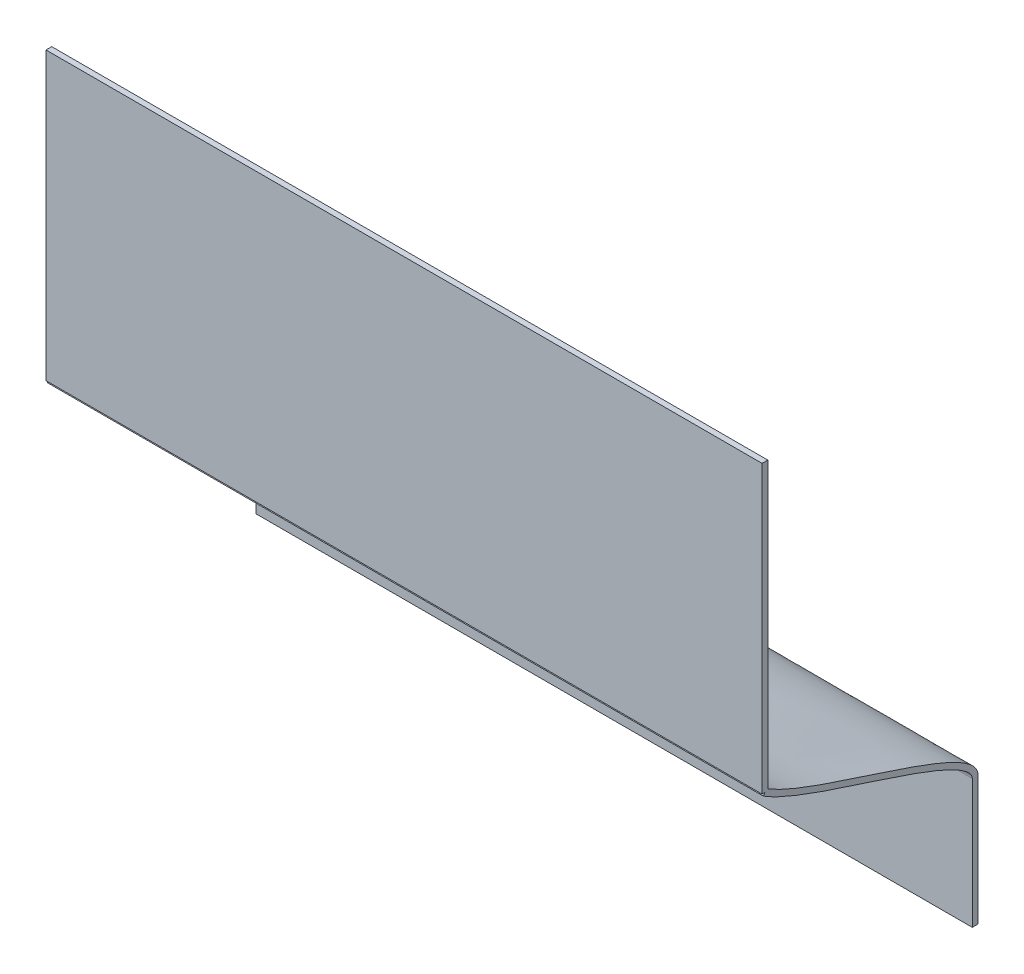
ISO-10303-21;
HEADER;
FILE_DESCRIPTION(('STEP AP214'),'2;1');
FILE_NAME('part.step','',(''),(''),'','','');
FILE_SCHEMA(('AUTOMOTIVE_DESIGN { 1 0 10303 214 1 1 1 1 }'));
ENDSEC;
DATA;
#1=APPLICATION_CONTEXT('core data for automotive mechanical design processes');
#2=APPLICATION_PROTOCOL_DEFINITION('international standard','automotive_design',2000,#1);
#3=PRODUCT_CONTEXT('',#1,'mechanical');
#4=PRODUCT('Part','Part','',(#3));
#5=PRODUCT_RELATED_PRODUCT_CATEGORY('part','',(#4));
#6=PRODUCT_DEFINITION_FORMATION('','',#4);
#7=PRODUCT_DEFINITION_CONTEXT('part definition',#1,'design');
#8=PRODUCT_DEFINITION('design','',#6,#7);
#9=PRODUCT_DEFINITION_SHAPE('','',#8);
#10=(LENGTH_UNIT() NAMED_UNIT(*) SI_UNIT(.MILLI.,.METRE.));
#11=(NAMED_UNIT(*) PLANE_ANGLE_UNIT() SI_UNIT($,.RADIAN.));
#12=(NAMED_UNIT(*) SI_UNIT($,.STERADIAN.) SOLID_ANGLE_UNIT());
#13=UNCERTAINTY_MEASURE_WITH_UNIT(LENGTH_MEASURE(1.E-05),#10,'distance_accuracy_value','');
#14=(GEOMETRIC_REPRESENTATION_CONTEXT(3) GLOBAL_UNCERTAINTY_ASSIGNED_CONTEXT((#13)) GLOBAL_UNIT_ASSIGNED_CONTEXT((#10,
#11,#12)) REPRESENTATION_CONTEXT('',''));
#15=CARTESIAN_POINT('',(0.,0.,0.));
#16=DIRECTION('',(0.,0.,1.));
#17=DIRECTION('',(1.,0.,0.));
#18=AXIS2_PLACEMENT_3D('',#15,#16,#17);
#19=CARTESIAN_POINT('',(0.,5.36538784360869,7.29329899615201));
#20=DIRECTION('',(0.,0.532989961520087,0.846121563913139));
#21=DIRECTION('',(-1.,0.,0.));
#22=AXIS2_PLACEMENT_3D('',#19,#20,#21);
#23=PLANE('',#22);
#24=DIRECTION('',(0.,0.846121563913139,-0.532989961520087));
#25=VECTOR('',#24,1.);
#26=CARTESIAN_POINT('',(12.5,5.36538784360869,7.29329899615201));
#27=LINE('',#26,#25);
#28=CARTESIAN_POINT('',(12.5,5.36538784360869,7.29329899615201));
#29=VERTEX_POINT('',#28);
#30=CARTESIAN_POINT('',(12.5,5.45000000000001,7.24));
#31=VERTEX_POINT('',#30);
#32=EDGE_CURVE('E167',#29,#31,#27,.T.);
#33=ORIENTED_EDGE('',*,*,#32,.T.);
#34=DIRECTION('',(-1.,0.,0.));
#35=VECTOR('',#34,1.);
#36=CARTESIAN_POINT('',(0.,5.45000000000001,7.24));
#37=LINE('',#36,#35);
#38=CARTESIAN_POINT('',(-12.5,5.45000000000001,7.24));
#39=VERTEX_POINT('',#38);
#40=EDGE_CURVE('E11',#31,#39,#37,.T.);
#41=ORIENTED_EDGE('',*,*,#40,.T.);
#42=DIRECTION('',(0.,-0.846121563913139,0.532989961520087));
#43=VECTOR('',#42,1.);
#44=CARTESIAN_POINT('',(-12.5,5.53461215639132,7.18670100384799));
#45=LINE('',#44,#43);
#46=CARTESIAN_POINT('',(-12.5,5.36538784360869,7.29329899615201));
#47=VERTEX_POINT('',#46);
#48=EDGE_CURVE('E149',#39,#47,#45,.T.);
#49=ORIENTED_EDGE('',*,*,#48,.T.);
#50=DIRECTION('',(1.,0.,0.));
#51=VECTOR('',#50,1.);
#52=CARTESIAN_POINT('',(-12.5,5.36538784360869,7.29329899615201));
#53=LINE('',#52,#51);
#54=EDGE_CURVE('E151',#47,#29,#53,.T.);
#55=ORIENTED_EDGE('',*,*,#54,.T.);
#56=EDGE_LOOP('',(#33,#41,#49,#55));
#57=FACE_BOUND('',#56,.T.);
#58=ADVANCED_FACE('F35',(#57),#23,.T.);
#59=CARTESIAN_POINT('',(12.5,2.25000000000001,-0.2));
#60=CARTESIAN_POINT('',(12.5,2.34111976886381,-0.199999900198077));
#61=CARTESIAN_POINT('',(12.5,2.42678009284915,-0.167606025043886));
#62=CARTESIAN_POINT('',(12.5,2.58409405696768,-0.0628201092410751));
#63=CARTESIAN_POINT('',(12.5,2.6569705568427,0.00960294741212795));
#64=CARTESIAN_POINT('',(12.5,2.87016752896252,0.275656685973047));
#65=CARTESIAN_POINT('',(12.5,3.00556691664487,0.51956146608584));
#66=CARTESIAN_POINT('',(12.5,3.41107928163634,1.39497709864719));
#67=CARTESIAN_POINT('',(12.5,3.67804817930948,2.17061541078781));
#68=CARTESIAN_POINT('',(12.5,4.21195982334858,3.79570896205555));
#69=CARTESIAN_POINT('',(12.5,4.47849036083489,4.6448641891336));
#70=CARTESIAN_POINT('',(12.5,5.00988620985733,6.13474438618378));
#71=CARTESIAN_POINT('',(12.5,5.27610427714114,6.77631972264641));
#72=CARTESIAN_POINT('',(12.5,5.53461215639132,7.18670100384799));
#73=CARTESIAN_POINT('',(-12.5,2.25000000000001,-0.2));
#74=CARTESIAN_POINT('',(-12.5,2.34111976886383,-0.199999900198073));
#75=CARTESIAN_POINT('',(-12.5,2.42678009284913,-0.167606025043884));
#76=CARTESIAN_POINT('',(-12.5,2.5840940569677,-0.0628201092410732));
#77=CARTESIAN_POINT('',(-12.5,2.65697055684268,0.00960294741213055));
#78=CARTESIAN_POINT('',(-12.5,2.87016752896257,0.275656685973049));
#79=CARTESIAN_POINT('',(-12.5,3.00556691664494,0.519561466085843));
#80=CARTESIAN_POINT('',(-12.5,3.41107928163621,1.3949770986472));
#81=CARTESIAN_POINT('',(-12.5,3.67804817930948,2.17061541078763));
#82=CARTESIAN_POINT('',(-12.5,4.21195982334858,3.79570896205573));
#83=CARTESIAN_POINT('',(-12.5,4.47849036083455,4.64486418913326));
#84=CARTESIAN_POINT('',(-12.5,5.00988620985767,6.13474438618412));
#85=CARTESIAN_POINT('',(-12.5,5.27610427714095,6.77631972264611));
#86=CARTESIAN_POINT('',(-12.5,5.53461215639132,7.18670100384799));
#87=B_SPLINE_SURFACE_WITH_KNOTS('',1,3,((#59,#60,#61,#62,#63,#64,#65,#66,#67,#68,#69,#70,#71,
#72),(#73,#74,#75,#76,#77,#78,#79,#80,#81,#82,#83,#84,#85,#86)),.UNSPECIFIED.,.F.,.F.,.F.,(2,2),
(4,2,2,2,2,2,4),(0.,1.),(0.,0.0625,0.125,0.25,0.5,0.75,1.),.UNSPECIFIED.);
#88=CARTESIAN_POINT('',(-12.5,2.25000000000001,-0.2));
#89=CARTESIAN_POINT('',(-12.5,2.34111976886383,-0.199999900198073));
#90=CARTESIAN_POINT('',(-12.5,2.42678009284913,-0.167606025043884));
#91=CARTESIAN_POINT('',(-12.5,2.5840940569677,-0.0628201092410732));
#92=CARTESIAN_POINT('',(-12.5,2.65697055684268,0.00960294741213055));
#93=CARTESIAN_POINT('',(-12.5,2.87016752896257,0.275656685973049));
#94=CARTESIAN_POINT('',(-12.5,3.00556691664494,0.519561466085843));
#95=CARTESIAN_POINT('',(-12.5,3.41107928163621,1.3949770986472));
#96=CARTESIAN_POINT('',(-12.5,3.67804817930948,2.17061541078763));
#97=CARTESIAN_POINT('',(-12.5,4.21195982334858,3.79570896205573));
#98=CARTESIAN_POINT('',(-12.5,4.47849036083455,4.64486418913326));
#99=CARTESIAN_POINT('',(-12.5,5.00988620985767,6.13474438618412));
#100=CARTESIAN_POINT('',(-12.5,5.27610427714095,6.77631972264611));
#101=CARTESIAN_POINT('',(-12.5,5.53461215639132,7.18670100384799));
#102=B_SPLINE_CURVE_WITH_KNOTS('',3,(#88,#89,#90,#91,#92,#93,#94,#95,#96,#97,#98,#99,#100,#101),
.UNSPECIFIED.,.F.,.F.,(4,2,2,2,2,2,4),(0.,0.0625,0.125,0.25,0.5,0.75,1.),.UNSPECIFIED.);
#103=CARTESIAN_POINT('',(-12.5,2.25000000000001,-0.2));
#104=VERTEX_POINT('',#103);
#105=CARTESIAN_POINT('',(-12.5,5.50576186846246,7.14));
#106=VERTEX_POINT('',#105);
#107=EDGE_CURVE('E140',#104,#106,#102,.T.);
#108=DIRECTION('',(-1.,0.,0.));
#109=VECTOR('',#108,1.);
#110=CARTESIAN_POINT('',(0.,5.50576186846246,7.14));
#111=LINE('',#110,#109);
#112=CARTESIAN_POINT('',(12.5,5.50576186846246,7.14));
#113=VERTEX_POINT('',#112);
#114=EDGE_CURVE('E43',#106,#113,#111,.F.);
#115=CARTESIAN_POINT('',(12.5,2.25000000000001,-0.2));
#116=CARTESIAN_POINT('',(12.5,2.34111976886381,-0.199999900198077));
#117=CARTESIAN_POINT('',(12.5,2.42678009284915,-0.167606025043886));
#118=CARTESIAN_POINT('',(12.5,2.58409405696768,-0.0628201092410751));
#119=CARTESIAN_POINT('',(12.5,2.6569705568427,0.00960294741212795));
#120=CARTESIAN_POINT('',(12.5,2.87016752896252,0.275656685973047));
#121=CARTESIAN_POINT('',(12.5,3.00556691664487,0.51956146608584));
#122=CARTESIAN_POINT('',(12.5,3.41107928163634,1.39497709864719));
#123=CARTESIAN_POINT('',(12.5,3.67804817930948,2.17061541078781));
#124=CARTESIAN_POINT('',(12.5,4.21195982334858,3.79570896205555));
#125=CARTESIAN_POINT('',(12.5,4.47849036083489,4.6448641891336));
#126=CARTESIAN_POINT('',(12.5,5.00988620985733,6.13474438618378));
#127=CARTESIAN_POINT('',(12.5,5.27610427714114,6.77631972264641));
#128=CARTESIAN_POINT('',(12.5,5.53461215639132,7.18670100384799));
#129=B_SPLINE_CURVE_WITH_KNOTS('',3,(#115,#116,#117,#118,#119,#120,#121,#122,#123,#124,#125,
#126,#127,#128),.UNSPECIFIED.,.F.,.F.,(4,2,2,2,2,2,4),(0.,0.0625,0.125,0.25,0.5,0.75,1.),.UNSPECIFIED.);
#130=CARTESIAN_POINT('',(12.5,2.25000000000001,-0.2));
#131=VERTEX_POINT('',#130);
#132=EDGE_CURVE('E152',#131,#113,#129,.T.);
#133=DIRECTION('',(-1.,0.,0.));
#134=VECTOR('',#133,1.);
#135=CARTESIAN_POINT('',(-12.5,2.25000000000001,-0.2));
#136=LINE('',#135,#134);
#137=EDGE_CURVE('E82',#131,#104,#136,.T.);
#138=ORIENTED_EDGE('',*,*,#107,.T.);
#139=ORIENTED_EDGE('',*,*,#114,.T.);
#140=ORIENTED_EDGE('',*,*,#132,.F.);
#141=ORIENTED_EDGE('',*,*,#137,.T.);
#142=EDGE_LOOP('',(#138,#139,#140,#141));
#143=FACE_BOUND('',#142,.T.);
#144=ADVANCED_FACE('F205',(#143),#87,.T.);
#145=CARTESIAN_POINT('',(12.5,2.25000000000001,-0.2));
#146=DIRECTION('',(1.,0.,0.));
#147=DIRECTION('',(0.,0.,-1.));
#148=AXIS2_PLACEMENT_3D('',#145,#146,#147);
#149=PLANE('',#148);
#150=DIRECTION('',(0.,0.,-1.));
#151=VECTOR('',#150,1.);
#152=CARTESIAN_POINT('',(12.5,5.45000000000001,7.34));
#153=LINE('',#152,#151);
#154=CARTESIAN_POINT('',(12.5,5.45000000000001,7.34));
#155=VERTEX_POINT('',#154);
#156=EDGE_CURVE('E221',#155,#31,#153,.T.);
#157=ORIENTED_EDGE('',*,*,#156,.T.);
#158=ORIENTED_EDGE('',*,*,#32,.F.);
#159=CARTESIAN_POINT('',(12.5,2.25000000000001,0.));
#160=CARTESIAN_POINT('',(12.5,2.29221356452214,-5.14521191429565E-09));
#161=CARTESIAN_POINT('',(12.5,2.3398865738175,0.0148212267414871));
#162=CARTESIAN_POINT('',(12.5,2.44923927636569,0.0876605716059741));
#163=CARTESIAN_POINT('',(12.5,2.50969610982398,0.145647721935439));
#164=CARTESIAN_POINT('',(12.5,2.69649913770415,0.37876385033182));
#165=CARTESIAN_POINT('',(12.5,2.82776641668844,0.611558341208864));
#166=CARTESIAN_POINT('',(12.5,3.22225405169706,1.4631739117634));
#167=CARTESIAN_POINT('',(12.5,3.48861848735676,2.23480127110167));
#168=CARTESIAN_POINT('',(12.5,4.0213735099852,3.85637435605498));
#169=CARTESIAN_POINT('',(12.5,4.28817618828164,4.70662001455525));
#170=CARTESIAN_POINT('',(12.5,4.82344724102616,6.20736516012738));
#171=CARTESIAN_POINT('',(12.5,5.09112243714558,6.85790261502571));
#172=CARTESIAN_POINT('',(12.5,5.36538784360869,7.29329899615201));
#173=B_SPLINE_CURVE_WITH_KNOTS('',3,(#159,#160,#161,#162,#163,#164,#165,#166,#167,#168,#169,
#170,#171,#172),.UNSPECIFIED.,.F.,.F.,(4,2,2,2,2,2,4),(0.,0.0625,0.125,0.25,0.5,0.75,1.),.UNSPECIFIED.);
#174=CARTESIAN_POINT('',(12.5,2.25000000000001,0.));
#175=VERTEX_POINT('',#174);
#176=EDGE_CURVE('E156',#175,#29,#173,.T.);
#177=ORIENTED_EDGE('',*,*,#176,.F.);
#178=DIRECTION('',(0.,1.,0.));
#179=VECTOR('',#178,1.);
#180=CARTESIAN_POINT('',(12.5,2.25000000000001,0.));
#181=LINE('',#180,#179);
#182=CARTESIAN_POINT('',(12.5,-2.24999999999999,0.));
#183=VERTEX_POINT('',#182);
#184=EDGE_CURVE('E177',#183,#175,#181,.T.);
#185=ORIENTED_EDGE('',*,*,#184,.F.);
#186=DIRECTION('',(0.,0.,1.));
#187=VECTOR('',#186,1.);
#188=CARTESIAN_POINT('',(12.5,-2.24999999999999,-0.2));
#189=LINE('',#188,#187);
#190=CARTESIAN_POINT('',(12.5,-2.24999999999999,-0.2));
#191=VERTEX_POINT('',#190);
#192=EDGE_CURVE('E59',#191,#183,#189,.T.);
#193=ORIENTED_EDGE('',*,*,#192,.F.);
#194=DIRECTION('',(0.,1.,0.));
#195=VECTOR('',#194,1.);
#196=CARTESIAN_POINT('',(12.5,2.25000000000001,-0.2));
#197=LINE('',#196,#195);
#198=EDGE_CURVE('E181',#191,#131,#197,.T.);
#199=ORIENTED_EDGE('',*,*,#198,.T.);
#200=ORIENTED_EDGE('',*,*,#132,.T.);
#201=DIRECTION('',(0.,1.,0.));
#202=VECTOR('',#201,1.);
#203=CARTESIAN_POINT('',(12.5,5.45000000000001,7.14));
#204=LINE('',#203,#202);
#205=CARTESIAN_POINT('',(12.5,15.45,7.14));
#206=VERTEX_POINT('',#205);
#207=EDGE_CURVE('E50',#113,#206,#204,.T.);
#208=ORIENTED_EDGE('',*,*,#207,.T.);
#209=DIRECTION('',(0.,0.,-1.));
#210=VECTOR('',#209,1.);
#211=CARTESIAN_POINT('',(12.5,15.45,7.34));
#212=LINE('',#211,#210);
#213=CARTESIAN_POINT('',(12.5,15.45,7.34));
#214=VERTEX_POINT('',#213);
#215=EDGE_CURVE('E123',#214,#206,#212,.T.);
#216=ORIENTED_EDGE('',*,*,#215,.F.);
#217=DIRECTION('',(0.,1.,0.));
#218=VECTOR('',#217,1.);
#219=CARTESIAN_POINT('',(12.5,5.45000000000001,7.34));
#220=LINE('',#219,#218);
#221=EDGE_CURVE('E129',#155,#214,#220,.T.);
#222=ORIENTED_EDGE('',*,*,#221,.F.);
#223=EDGE_LOOP('',(#157,#158,#177,#185,#193,#199,#200,#208,#216,#222));
#224=FACE_BOUND('',#223,.T.);
#225=ADVANCED_FACE('F37',(#224),#149,.T.);
#226=CARTESIAN_POINT('',(-12.5,-2.25,-0.2));
#227=DIRECTION('',(0.,-1.,0.));
#228=DIRECTION('',(1.,0.,0.));
#229=AXIS2_PLACEMENT_3D('',#226,#227,#228);
#230=PLANE('',#229);
#231=DIRECTION('',(1.,0.,0.));
#232=VECTOR('',#231,1.);
#233=CARTESIAN_POINT('',(-12.5,-2.25,0.));
#234=LINE('',#233,#232);
#235=CARTESIAN_POINT('',(-12.5,-2.25,0.));
#236=VERTEX_POINT('',#235);
#237=EDGE_CURVE('E186',#236,#183,#234,.T.);
#238=ORIENTED_EDGE('',*,*,#237,.F.);
#239=DIRECTION('',(0.,0.,1.));
#240=VECTOR('',#239,1.);
#241=CARTESIAN_POINT('',(-12.5,-2.25,-0.2));
#242=LINE('',#241,#240);
#243=CARTESIAN_POINT('',(-12.5,-2.25,-0.2));
#244=VERTEX_POINT('',#243);
#245=EDGE_CURVE('E193',#244,#236,#242,.T.);
#246=ORIENTED_EDGE('',*,*,#245,.F.);
#247=DIRECTION('',(1.,0.,0.));
#248=VECTOR('',#247,1.);
#249=CARTESIAN_POINT('',(-12.5,-2.25,-0.2));
#250=LINE('',#249,#248);
#251=EDGE_CURVE('E191',#244,#191,#250,.T.);
#252=ORIENTED_EDGE('',*,*,#251,.T.);
#253=ORIENTED_EDGE('',*,*,#192,.T.);
#254=EDGE_LOOP('',(#238,#246,#252,#253));
#255=FACE_BOUND('',#254,.T.);
#256=ADVANCED_FACE('F211',(#255),#230,.T.);
#257=CARTESIAN_POINT('',(-12.5,2.25000000000001,-0.2));
#258=DIRECTION('',(-1.,0.,0.));
#259=DIRECTION('',(0.,0.,1.));
#260=AXIS2_PLACEMENT_3D('',#257,#258,#259);
#261=PLANE('',#260);
#262=ORIENTED_EDGE('',*,*,#48,.F.);
#263=DIRECTION('',(0.,0.,-1.));
#264=VECTOR('',#263,1.);
#265=CARTESIAN_POINT('',(-12.5,5.45000000000001,7.34));
#266=LINE('',#265,#264);
#267=CARTESIAN_POINT('',(-12.5,5.45000000000001,7.34));
#268=VERTEX_POINT('',#267);
#269=EDGE_CURVE('E145',#268,#39,#266,.T.);
#270=ORIENTED_EDGE('',*,*,#269,.F.);
#271=DIRECTION('',(0.,-1.,0.));
#272=VECTOR('',#271,1.);
#273=CARTESIAN_POINT('',(-12.5,5.45000000000001,7.34));
#274=LINE('',#273,#272);
#275=CARTESIAN_POINT('',(-12.5,15.45,7.34));
#276=VERTEX_POINT('',#275);
#277=EDGE_CURVE('E128',#276,#268,#274,.T.);
#278=ORIENTED_EDGE('',*,*,#277,.F.);
#279=DIRECTION('',(0.,0.,-1.));
#280=VECTOR('',#279,1.);
#281=CARTESIAN_POINT('',(-12.5,15.45,7.34));
#282=LINE('',#281,#280);
#283=CARTESIAN_POINT('',(-12.5,15.45,7.14));
#284=VERTEX_POINT('',#283);
#285=EDGE_CURVE('E125',#276,#284,#282,.T.);
#286=ORIENTED_EDGE('',*,*,#285,.T.);
#287=DIRECTION('',(0.,-1.,0.));
#288=VECTOR('',#287,1.);
#289=CARTESIAN_POINT('',(-12.5,5.45000000000001,7.14));
#290=LINE('',#289,#288);
#291=EDGE_CURVE('E137',#284,#106,#290,.T.);
#292=ORIENTED_EDGE('',*,*,#291,.T.);
#293=ORIENTED_EDGE('',*,*,#107,.F.);
#294=DIRECTION('',(0.,-1.,0.));
#295=VECTOR('',#294,1.);
#296=CARTESIAN_POINT('',(-12.5,2.25000000000001,-0.2));
#297=LINE('',#296,#295);
#298=EDGE_CURVE('E188',#104,#244,#297,.T.);
#299=ORIENTED_EDGE('',*,*,#298,.T.);
#300=ORIENTED_EDGE('',*,*,#245,.T.);
#301=DIRECTION('',(0.,-1.,0.));
#302=VECTOR('',#301,1.);
#303=CARTESIAN_POINT('',(-12.5,2.25000000000001,0.));
#304=LINE('',#303,#302);
#305=CARTESIAN_POINT('',(-12.5,2.25000000000001,0.));
#306=VERTEX_POINT('',#305);
#307=EDGE_CURVE('E197',#306,#236,#304,.T.);
#308=ORIENTED_EDGE('',*,*,#307,.F.);
#309=CARTESIAN_POINT('',(-12.5,2.25000000000001,0.));
#310=CARTESIAN_POINT('',(-12.5,2.29221356452213,-5.14521091780681E-09));
#311=CARTESIAN_POINT('',(-12.5,2.33988657381752,0.014821226741489));
#312=CARTESIAN_POINT('',(-12.5,2.44923927636568,0.0876605716059761));
#313=CARTESIAN_POINT('',(-12.5,2.50969610982398,0.145647721935442));
#314=CARTESIAN_POINT('',(-12.5,2.69649913770415,0.378763850331823));
#315=CARTESIAN_POINT('',(-12.5,2.82776641668837,0.611558341208867));
#316=CARTESIAN_POINT('',(-12.5,3.2222540516972,1.4631739117634));
#317=CARTESIAN_POINT('',(-12.5,3.48861848735676,2.23480127110148));
#318=CARTESIAN_POINT('',(-12.5,4.0213735099852,3.85637435605517));
#319=CARTESIAN_POINT('',(-12.5,4.28817618828164,4.70662001455525));
#320=CARTESIAN_POINT('',(-12.5,4.82344724102616,6.20736516012738));
#321=CARTESIAN_POINT('',(-12.5,5.0911224371465,6.85790261502513));
#322=CARTESIAN_POINT('',(-12.5,5.36538784360869,7.29329899615201));
#323=B_SPLINE_CURVE_WITH_KNOTS('',3,(#309,#310,#311,#312,#313,#314,#315,#316,#317,#318,#319,
#320,#321,#322),.UNSPECIFIED.,.F.,.F.,(4,2,2,2,2,2,4),(0.,0.0625,0.125,0.25,0.5,0.75,1.),.UNSPECIFIED.);
#324=EDGE_CURVE('E143',#306,#47,#323,.T.);
#325=ORIENTED_EDGE('',*,*,#324,.T.);
#326=EDGE_LOOP('',(#262,#270,#278,#286,#292,#293,#299,#300,#308,#325));
#327=FACE_BOUND('',#326,.T.);
#328=ADVANCED_FACE('F215',(#327),#261,.T.);
#329=CARTESIAN_POINT('',(0.,0.,-0.2));
#330=DIRECTION('',(0.,0.,1.));
#331=DIRECTION('',(1.,0.,0.));
#332=AXIS2_PLACEMENT_3D('',#329,#330,#331);
#333=PLANE('',#332);
#334=ORIENTED_EDGE('',*,*,#198,.F.);
#335=ORIENTED_EDGE('',*,*,#251,.F.);
#336=ORIENTED_EDGE('',*,*,#298,.F.);
#337=ORIENTED_EDGE('',*,*,#137,.F.);
#338=EDGE_LOOP('',(#334,#335,#336,#337));
#339=FACE_BOUND('',#338,.T.);
#340=ADVANCED_FACE('F210',(#339),#333,.F.);
#341=CARTESIAN_POINT('',(0.,0.,0.));
#342=DIRECTION('',(0.,0.,1.));
#343=DIRECTION('',(1.,0.,0.));
#344=AXIS2_PLACEMENT_3D('',#341,#342,#343);
#345=PLANE('',#344);
#346=ORIENTED_EDGE('',*,*,#184,.T.);
#347=DIRECTION('',(-1.,0.,0.));
#348=VECTOR('',#347,1.);
#349=CARTESIAN_POINT('',(-12.5,2.25000000000001,0.));
#350=LINE('',#349,#348);
#351=EDGE_CURVE('E195',#175,#306,#350,.T.);
#352=ORIENTED_EDGE('',*,*,#351,.T.);
#353=ORIENTED_EDGE('',*,*,#307,.T.);
#354=ORIENTED_EDGE('',*,*,#237,.T.);
#355=EDGE_LOOP('',(#346,#352,#353,#354));
#356=FACE_BOUND('',#355,.T.);
#357=ADVANCED_FACE('F234',(#356),#345,.T.);
#358=CARTESIAN_POINT('',(-12.5,2.25000000000001,0.));
#359=CARTESIAN_POINT('',(-12.5,2.29221356452213,-5.14521091780681E-09));
#360=CARTESIAN_POINT('',(-12.5,2.33988657381752,0.014821226741489));
#361=CARTESIAN_POINT('',(-12.5,2.44923927636568,0.0876605716059761));
#362=CARTESIAN_POINT('',(-12.5,2.50969610982398,0.145647721935442));
#363=CARTESIAN_POINT('',(-12.5,2.69649913770415,0.378763850331823));
#364=CARTESIAN_POINT('',(-12.5,2.82776641668837,0.611558341208867));
#365=CARTESIAN_POINT('',(-12.5,3.2222540516972,1.4631739117634));
#366=CARTESIAN_POINT('',(-12.5,3.48861848735676,2.23480127110148));
#367=CARTESIAN_POINT('',(-12.5,4.0213735099852,3.85637435605517));
#368=CARTESIAN_POINT('',(-12.5,4.28817618828164,4.70662001455525));
#369=CARTESIAN_POINT('',(-12.5,4.82344724102616,6.20736516012738));
#370=CARTESIAN_POINT('',(-12.5,5.0911224371465,6.85790261502513));
#371=CARTESIAN_POINT('',(-12.5,5.36538784360869,7.29329899615201));
#372=CARTESIAN_POINT('',(12.5,2.25000000000001,0.));
#373=CARTESIAN_POINT('',(12.5,2.29221356452214,-5.14521191429565E-09));
#374=CARTESIAN_POINT('',(12.5,2.3398865738175,0.0148212267414871));
#375=CARTESIAN_POINT('',(12.5,2.44923927636569,0.0876605716059741));
#376=CARTESIAN_POINT('',(12.5,2.50969610982398,0.145647721935439));
#377=CARTESIAN_POINT('',(12.5,2.69649913770415,0.37876385033182));
#378=CARTESIAN_POINT('',(12.5,2.82776641668844,0.611558341208864));
#379=CARTESIAN_POINT('',(12.5,3.22225405169706,1.4631739117634));
#380=CARTESIAN_POINT('',(12.5,3.48861848735676,2.23480127110167));
#381=CARTESIAN_POINT('',(12.5,4.0213735099852,3.85637435605498));
#382=CARTESIAN_POINT('',(12.5,4.28817618828164,4.70662001455525));
#383=CARTESIAN_POINT('',(12.5,4.82344724102616,6.20736516012738));
#384=CARTESIAN_POINT('',(12.5,5.09112243714558,6.85790261502571));
#385=CARTESIAN_POINT('',(12.5,5.36538784360869,7.29329899615201));
#386=B_SPLINE_SURFACE_WITH_KNOTS('',1,3,((#358,#359,#360,#361,#362,#363,#364,#365,#366,#367,
#368,#369,#370,#371),(#372,#373,#374,#375,#376,#377,#378,#379,#380,#381,#382,#383,#384,#385)),
.UNSPECIFIED.,.F.,.F.,.F.,(2,2),(4,2,2,2,2,2,4),(0.,1.),(0.,0.0625,0.125,0.25,0.5,0.75,1.),.UNSPECIFIED.);
#387=ORIENTED_EDGE('',*,*,#176,.T.);
#388=ORIENTED_EDGE('',*,*,#54,.F.);
#389=ORIENTED_EDGE('',*,*,#324,.F.);
#390=ORIENTED_EDGE('',*,*,#351,.F.);
#391=EDGE_LOOP('',(#387,#388,#389,#390));
#392=FACE_BOUND('',#391,.T.);
#393=ADVANCED_FACE('F231',(#392),#386,.T.);
#394=CARTESIAN_POINT('',(12.5,15.45,7.34));
#395=DIRECTION('',(0.,-1.,0.));
#396=DIRECTION('',(0.,0.,-1.));
#397=AXIS2_PLACEMENT_3D('',#394,#395,#396);
#398=PLANE('',#397);
#399=DIRECTION('',(-1.,0.,0.));
#400=VECTOR('',#399,1.);
#401=CARTESIAN_POINT('',(12.5,15.45,7.14));
#402=LINE('',#401,#400);
#403=EDGE_CURVE('E216',#206,#284,#402,.T.);
#404=ORIENTED_EDGE('',*,*,#403,.T.);
#405=ORIENTED_EDGE('',*,*,#285,.F.);
#406=DIRECTION('',(-1.,0.,0.));
#407=VECTOR('',#406,1.);
#408=CARTESIAN_POINT('',(12.5,15.45,7.34));
#409=LINE('',#408,#407);
#410=EDGE_CURVE('E119',#214,#276,#409,.T.);
#411=ORIENTED_EDGE('',*,*,#410,.F.);
#412=ORIENTED_EDGE('',*,*,#215,.T.);
#413=EDGE_LOOP('',(#404,#405,#411,#412));
#414=FACE_BOUND('',#413,.T.);
#415=ADVANCED_FACE('F121',(#414),#398,.F.);
#416=CARTESIAN_POINT('',(12.5,5.45000000000001,7.34));
#417=DIRECTION('',(0.,1.,0.));
#418=DIRECTION('',(0.,0.,1.));
#419=AXIS2_PLACEMENT_3D('',#416,#417,#418);
#420=PLANE('',#419);
#421=ORIENTED_EDGE('',*,*,#40,.F.);
#422=ORIENTED_EDGE('',*,*,#156,.F.);
#423=DIRECTION('',(1.,0.,0.));
#424=VECTOR('',#423,1.);
#425=CARTESIAN_POINT('',(12.5,5.45000000000001,7.34));
#426=LINE('',#425,#424);
#427=EDGE_CURVE('E134',#268,#155,#426,.T.);
#428=ORIENTED_EDGE('',*,*,#427,.F.);
#429=ORIENTED_EDGE('',*,*,#269,.T.);
#430=EDGE_LOOP('',(#421,#422,#428,#429));
#431=FACE_BOUND('',#430,.T.);
#432=ADVANCED_FACE('F224',(#431),#420,.F.);
#433=CARTESIAN_POINT('',(0.,0.,7.34));
#434=DIRECTION('',(0.,0.,1.));
#435=DIRECTION('',(1.,0.,0.));
#436=AXIS2_PLACEMENT_3D('',#433,#434,#435);
#437=PLANE('',#436);
#438=ORIENTED_EDGE('',*,*,#221,.T.);
#439=ORIENTED_EDGE('',*,*,#410,.T.);
#440=ORIENTED_EDGE('',*,*,#277,.T.);
#441=ORIENTED_EDGE('',*,*,#427,.T.);
#442=EDGE_LOOP('',(#438,#439,#440,#441));
#443=FACE_BOUND('',#442,.T.);
#444=ADVANCED_FACE('F132',(#443),#437,.T.);
#445=CARTESIAN_POINT('',(0.,0.,7.14));
#446=DIRECTION('',(0.,0.,1.));
#447=DIRECTION('',(1.,0.,0.));
#448=AXIS2_PLACEMENT_3D('',#445,#446,#447);
#449=PLANE('',#448);
#450=CARTESIAN_POINT('',(-7.49999999999999,7.95,7.14));
#451=DIRECTION('',(0.,0.,-1.));
#452=DIRECTION('',(-1.,0.,0.));
#453=AXIS2_PLACEMENT_3D('',#450,#451,#452);
#454=CIRCLE('',#453,0.500000000000001);
#455=CARTESIAN_POINT('',(-7.99999999999999,7.95,7.14));
#456=VERTEX_POINT('',#455);
#457=EDGE_CURVE('E340',#456,#456,#454,.T.);
#458=ORIENTED_EDGE('',*,*,#457,.F.);
#459=EDGE_LOOP('',(#458));
#460=FACE_BOUND('',#459,.T.);
#461=CARTESIAN_POINT('',(-7.49999999999999,12.95,7.14));
#462=DIRECTION('',(0.,0.,-1.));
#463=DIRECTION('',(1.,0.,0.));
#464=AXIS2_PLACEMENT_3D('',#461,#462,#463);
#465=CIRCLE('',#464,0.500000000000001);
#466=CARTESIAN_POINT('',(-6.99999999999999,12.95,7.14));
#467=VERTEX_POINT('',#466);
#468=EDGE_CURVE('E346',#467,#467,#465,.T.);
#469=ORIENTED_EDGE('',*,*,#468,.F.);
#470=EDGE_LOOP('',(#469));
#471=FACE_BOUND('',#470,.T.);
#472=CARTESIAN_POINT('',(7.50000000000001,12.95,7.14));
#473=DIRECTION('',(0.,0.,-1.));
#474=DIRECTION('',(-1.,0.,0.));
#475=AXIS2_PLACEMENT_3D('',#472,#473,#474);
#476=CIRCLE('',#475,0.500000000000001);
#477=CARTESIAN_POINT('',(7.00000000000001,12.95,7.14));
#478=VERTEX_POINT('',#477);
#479=EDGE_CURVE('E352',#478,#478,#476,.T.);
#480=ORIENTED_EDGE('',*,*,#479,.F.);
#481=EDGE_LOOP('',(#480));
#482=FACE_BOUND('',#481,.T.);
#483=CARTESIAN_POINT('',(7.50000000000001,7.95,7.14));
#484=DIRECTION('',(0.,0.,-1.));
#485=DIRECTION('',(1.,0.,0.));
#486=AXIS2_PLACEMENT_3D('',#483,#484,#485);
#487=CIRCLE('',#486,0.500000000000001);
#488=CARTESIAN_POINT('',(8.00000000000001,7.95,7.14));
#489=VERTEX_POINT('',#488);
#490=EDGE_CURVE('E327',#489,#489,#487,.T.);
#491=ORIENTED_EDGE('',*,*,#490,.F.);
#492=EDGE_LOOP('',(#491));
#493=FACE_BOUND('',#492,.T.);
#494=CARTESIAN_POINT('',(0.,7.95000000000001,7.14));
#495=DIRECTION('',(0.,0.,-1.));
#496=DIRECTION('',(-1.,0.,0.));
#497=AXIS2_PLACEMENT_3D('',#494,#495,#496);
#498=CIRCLE('',#497,0.5);
#499=CARTESIAN_POINT('',(-0.499999999999995,7.95000000000001,7.14));
#500=VERTEX_POINT('',#499);
#501=EDGE_CURVE('E328',#500,#500,#498,.T.);
#502=ORIENTED_EDGE('',*,*,#501,.F.);
#503=EDGE_LOOP('',(#502));
#504=FACE_BOUND('',#503,.T.);
#505=CARTESIAN_POINT('',(0.,12.95,7.14));
#506=DIRECTION('',(0.,0.,-1.));
#507=DIRECTION('',(-1.,0.,0.));
#508=AXIS2_PLACEMENT_3D('',#505,#506,#507);
#509=CIRCLE('',#508,0.5);
#510=CARTESIAN_POINT('',(-0.499999999999995,12.95,7.14));
#511=VERTEX_POINT('',#510);
#512=EDGE_CURVE('E339',#511,#511,#509,.T.);
#513=ORIENTED_EDGE('',*,*,#512,.F.);
#514=EDGE_LOOP('',(#513));
#515=FACE_BOUND('',#514,.T.);
#516=ORIENTED_EDGE('',*,*,#114,.F.);
#517=ORIENTED_EDGE('',*,*,#291,.F.);
#518=ORIENTED_EDGE('',*,*,#403,.F.);
#519=ORIENTED_EDGE('',*,*,#207,.F.);
#520=EDGE_LOOP('',(#516,#517,#518,#519));
#521=FACE_BOUND('',#520,.T.);
#522=ADVANCED_FACE('F269',(#460,#471,#482,#493,#504,#515,#521),#449,.F.);
#523=CARTESIAN_POINT('',(0.,12.95,7.24));
#524=DIRECTION('',(0.,0.,-1.));
#525=DIRECTION('',(-1.,0.,0.));
#526=AXIS2_PLACEMENT_3D('',#523,#524,#525);
#527=CYLINDRICAL_SURFACE('',#526,0.5);
#528=CARTESIAN_POINT('',(0.,12.95,7.24));
#529=DIRECTION('',(0.,0.,-1.));
#530=DIRECTION('',(-1.,0.,0.));
#531=AXIS2_PLACEMENT_3D('',#528,#529,#530);
#532=CIRCLE('',#531,0.5);
#533=CARTESIAN_POINT('',(-0.499999999999995,12.95,7.24));
#534=VERTEX_POINT('',#533);
#535=EDGE_CURVE('E357',#534,#534,#532,.T.);
#536=ORIENTED_EDGE('',*,*,#535,.F.);
#537=EDGE_LOOP('',(#536));
#538=FACE_BOUND('',#537,.T.);
#539=ORIENTED_EDGE('',*,*,#512,.T.);
#540=EDGE_LOOP('',(#539));
#541=FACE_BOUND('',#540,.T.);
#542=ADVANCED_FACE('F272',(#538,#541),#527,.F.);
#543=CARTESIAN_POINT('',(0.,12.95,7.24));
#544=DIRECTION('',(0.,0.,-1.));
#545=DIRECTION('',(-1.,0.,0.));
#546=AXIS2_PLACEMENT_3D('',#543,#544,#545);
#547=PLANE('',#546);
#548=ORIENTED_EDGE('',*,*,#535,.T.);
#549=EDGE_LOOP('',(#548));
#550=FACE_BOUND('',#549,.T.);
#551=ADVANCED_FACE('F278',(#550),#547,.T.);
#552=CARTESIAN_POINT('',(0.,7.95000000000001,7.24));
#553=DIRECTION('',(0.,0.,-1.));
#554=DIRECTION('',(-1.,0.,0.));
#555=AXIS2_PLACEMENT_3D('',#552,#553,#554);
#556=CYLINDRICAL_SURFACE('',#555,0.5);
#557=CARTESIAN_POINT('',(0.,7.95000000000001,7.24));
#558=DIRECTION('',(0.,0.,-1.));
#559=DIRECTION('',(-1.,0.,0.));
#560=AXIS2_PLACEMENT_3D('',#557,#558,#559);
#561=CIRCLE('',#560,0.5);
#562=CARTESIAN_POINT('',(-0.499999999999995,7.95000000000001,7.24));
#563=VERTEX_POINT('',#562);
#564=EDGE_CURVE('E326',#563,#563,#561,.T.);
#565=ORIENTED_EDGE('',*,*,#564,.F.);
#566=EDGE_LOOP('',(#565));
#567=FACE_BOUND('',#566,.T.);
#568=ORIENTED_EDGE('',*,*,#501,.T.);
#569=EDGE_LOOP('',(#568));
#570=FACE_BOUND('',#569,.T.);
#571=ADVANCED_FACE('F282',(#567,#570),#556,.F.);
#572=CARTESIAN_POINT('',(0.,7.95000000000001,7.24));
#573=DIRECTION('',(0.,0.,-1.));
#574=DIRECTION('',(-1.,0.,0.));
#575=AXIS2_PLACEMENT_3D('',#572,#573,#574);
#576=PLANE('',#575);
#577=ORIENTED_EDGE('',*,*,#564,.T.);
#578=EDGE_LOOP('',(#577));
#579=FACE_BOUND('',#578,.T.);
#580=ADVANCED_FACE('F288',(#579),#576,.T.);
#581=CARTESIAN_POINT('',(7.50000000000001,7.95,7.24));
#582=DIRECTION('',(0.,0.,-1.));
#583=DIRECTION('',(-1.,0.,0.));
#584=AXIS2_PLACEMENT_3D('',#581,#582,#583);
#585=CYLINDRICAL_SURFACE('',#584,0.500000000000001);
#586=CARTESIAN_POINT('',(7.50000000000001,7.95,7.24));
#587=DIRECTION('',(0.,0.,-1.));
#588=DIRECTION('',(1.,0.,0.));
#589=AXIS2_PLACEMENT_3D('',#586,#587,#588);
#590=CIRCLE('',#589,0.500000000000001);
#591=CARTESIAN_POINT('',(8.00000000000001,7.95,7.24));
#592=VERTEX_POINT('',#591);
#593=EDGE_CURVE('E331',#592,#592,#590,.T.);
#594=ORIENTED_EDGE('',*,*,#593,.F.);
#595=EDGE_LOOP('',(#594));
#596=FACE_BOUND('',#595,.T.);
#597=ORIENTED_EDGE('',*,*,#490,.T.);
#598=EDGE_LOOP('',(#597));
#599=FACE_BOUND('',#598,.T.);
#600=ADVANCED_FACE('F284',(#596,#599),#585,.F.);
#601=CARTESIAN_POINT('',(7.50000000000001,7.95,7.24));
#602=DIRECTION('',(0.,0.,1.));
#603=DIRECTION('',(1.,0.,0.));
#604=AXIS2_PLACEMENT_3D('',#601,#602,#603);
#605=PLANE('',#604);
#606=ORIENTED_EDGE('',*,*,#593,.T.);
#607=EDGE_LOOP('',(#606));
#608=FACE_BOUND('',#607,.T.);
#609=ADVANCED_FACE('F287',(#608),#605,.F.);
#610=CARTESIAN_POINT('',(7.50000000000001,12.95,7.24));
#611=DIRECTION('',(0.,0.,-1.));
#612=DIRECTION('',(-1.,0.,0.));
#613=AXIS2_PLACEMENT_3D('',#610,#611,#612);
#614=CYLINDRICAL_SURFACE('',#613,0.500000000000001);
#615=CARTESIAN_POINT('',(7.50000000000001,12.95,7.24));
#616=DIRECTION('',(0.,0.,-1.));
#617=DIRECTION('',(-1.,0.,0.));
#618=AXIS2_PLACEMENT_3D('',#615,#616,#617);
#619=CIRCLE('',#618,0.500000000000001);
#620=CARTESIAN_POINT('',(7.00000000000001,12.95,7.24));
#621=VERTEX_POINT('',#620);
#622=EDGE_CURVE('E349',#621,#621,#619,.T.);
#623=ORIENTED_EDGE('',*,*,#622,.F.);
#624=EDGE_LOOP('',(#623));
#625=FACE_BOUND('',#624,.T.);
#626=ORIENTED_EDGE('',*,*,#479,.T.);
#627=EDGE_LOOP('',(#626));
#628=FACE_BOUND('',#627,.T.);
#629=ADVANCED_FACE('F292',(#625,#628),#614,.F.);
#630=CARTESIAN_POINT('',(7.50000000000001,12.95,7.24));
#631=DIRECTION('',(0.,0.,-1.));
#632=DIRECTION('',(-1.,0.,0.));
#633=AXIS2_PLACEMENT_3D('',#630,#631,#632);
#634=PLANE('',#633);
#635=ORIENTED_EDGE('',*,*,#622,.T.);
#636=EDGE_LOOP('',(#635));
#637=FACE_BOUND('',#636,.T.);
#638=ADVANCED_FACE('F296',(#637),#634,.T.);
#639=CARTESIAN_POINT('',(-7.49999999999999,12.95,7.24));
#640=DIRECTION('',(0.,0.,-1.));
#641=DIRECTION('',(-1.,0.,0.));
#642=AXIS2_PLACEMENT_3D('',#639,#640,#641);
#643=CYLINDRICAL_SURFACE('',#642,0.500000000000001);
#644=CARTESIAN_POINT('',(-7.49999999999999,12.95,7.24));
#645=DIRECTION('',(0.,0.,-1.));
#646=DIRECTION('',(1.,0.,0.));
#647=AXIS2_PLACEMENT_3D('',#644,#645,#646);
#648=CIRCLE('',#647,0.500000000000001);
#649=CARTESIAN_POINT('',(-6.99999999999999,12.95,7.24));
#650=VERTEX_POINT('',#649);
#651=EDGE_CURVE('E343',#650,#650,#648,.T.);
#652=ORIENTED_EDGE('',*,*,#651,.F.);
#653=EDGE_LOOP('',(#652));
#654=FACE_BOUND('',#653,.T.);
#655=ORIENTED_EDGE('',*,*,#468,.T.);
#656=EDGE_LOOP('',(#655));
#657=FACE_BOUND('',#656,.T.);
#658=ADVANCED_FACE('F300',(#654,#657),#643,.F.);
#659=CARTESIAN_POINT('',(-7.49999999999999,12.95,7.24));
#660=DIRECTION('',(0.,0.,1.));
#661=DIRECTION('',(1.,0.,0.));
#662=AXIS2_PLACEMENT_3D('',#659,#660,#661);
#663=PLANE('',#662);
#664=ORIENTED_EDGE('',*,*,#651,.T.);
#665=EDGE_LOOP('',(#664));
#666=FACE_BOUND('',#665,.T.);
#667=ADVANCED_FACE('F304',(#666),#663,.F.);
#668=CARTESIAN_POINT('',(-7.49999999999999,7.95,7.24));
#669=DIRECTION('',(0.,0.,-1.));
#670=DIRECTION('',(-1.,0.,0.));
#671=AXIS2_PLACEMENT_3D('',#668,#669,#670);
#672=CYLINDRICAL_SURFACE('',#671,0.500000000000001);
#673=CARTESIAN_POINT('',(-7.49999999999999,7.95,7.24));
#674=DIRECTION('',(0.,0.,-1.));
#675=DIRECTION('',(-1.,0.,0.));
#676=AXIS2_PLACEMENT_3D('',#673,#674,#675);
#677=CIRCLE('',#676,0.500000000000001);
#678=CARTESIAN_POINT('',(-7.99999999999999,7.95,7.24));
#679=VERTEX_POINT('',#678);
#680=EDGE_CURVE('E336',#679,#679,#677,.T.);
#681=ORIENTED_EDGE('',*,*,#680,.F.);
#682=EDGE_LOOP('',(#681));
#683=FACE_BOUND('',#682,.T.);
#684=ORIENTED_EDGE('',*,*,#457,.T.);
#685=EDGE_LOOP('',(#684));
#686=FACE_BOUND('',#685,.T.);
#687=ADVANCED_FACE('F308',(#683,#686),#672,.F.);
#688=CARTESIAN_POINT('',(-7.49999999999999,7.95,7.24));
#689=DIRECTION('',(0.,0.,-1.));
#690=DIRECTION('',(-1.,0.,0.));
#691=AXIS2_PLACEMENT_3D('',#688,#689,#690);
#692=PLANE('',#691);
#693=ORIENTED_EDGE('',*,*,#680,.T.);
#694=EDGE_LOOP('',(#693));
#695=FACE_BOUND('',#694,.T.);
#696=ADVANCED_FACE('F312',(#695),#692,.T.);
#697=CLOSED_SHELL('',(#58,#144,#225,#256,#328,#340,#357,#393,#415,#432,#444,#522,#542,#551,#571,
#580,#600,#609,#629,#638,#658,#667,#687,#696));
#698=MANIFOLD_SOLID_BREP('B2',#697);
#699=ADVANCED_BREP_SHAPE_REPRESENTATION('',(#18,#698),#14);
#700=SHAPE_DEFINITION_REPRESENTATION(#9,#699);
ENDSEC;
END-ISO-10303-21;
